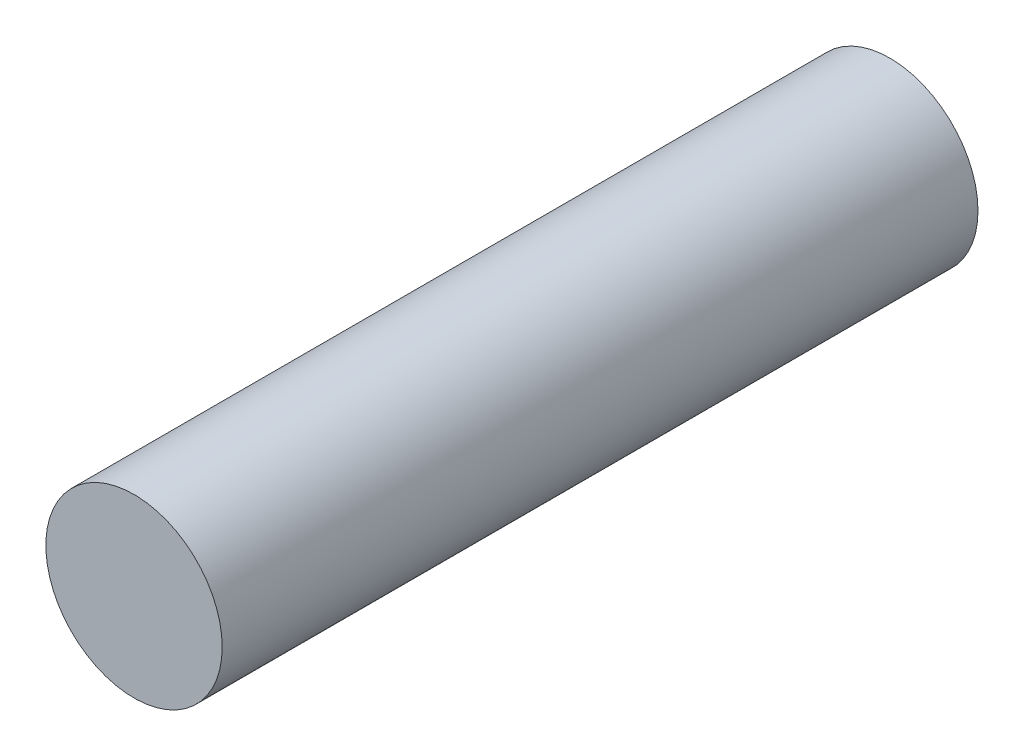
ISO-10303-21;
HEADER;
FILE_DESCRIPTION(('STEP AP214'),'2;1');
FILE_NAME('part.step','',(''),(''),'','','');
FILE_SCHEMA(('AUTOMOTIVE_DESIGN { 1 0 10303 214 1 1 1 1 }'));
ENDSEC;
DATA;
#1=APPLICATION_CONTEXT('core data for automotive mechanical design processes');
#2=APPLICATION_PROTOCOL_DEFINITION('international standard','automotive_design',2000,#1);
#3=PRODUCT_CONTEXT('',#1,'mechanical');
#4=PRODUCT('Part','Part','',(#3));
#5=PRODUCT_RELATED_PRODUCT_CATEGORY('part','',(#4));
#6=PRODUCT_DEFINITION_FORMATION('','',#4);
#7=PRODUCT_DEFINITION_CONTEXT('part definition',#1,'design');
#8=PRODUCT_DEFINITION('design','',#6,#7);
#9=PRODUCT_DEFINITION_SHAPE('','',#8);
#10=(LENGTH_UNIT() NAMED_UNIT(*) SI_UNIT(.MILLI.,.METRE.));
#11=(NAMED_UNIT(*) PLANE_ANGLE_UNIT() SI_UNIT($,.RADIAN.));
#12=(NAMED_UNIT(*) SI_UNIT($,.STERADIAN.) SOLID_ANGLE_UNIT());
#13=UNCERTAINTY_MEASURE_WITH_UNIT(LENGTH_MEASURE(1.E-05),#10,'distance_accuracy_value','');
#14=(GEOMETRIC_REPRESENTATION_CONTEXT(3) GLOBAL_UNCERTAINTY_ASSIGNED_CONTEXT((#13)) GLOBAL_UNIT_ASSIGNED_CONTEXT((#10,
#11,#12)) REPRESENTATION_CONTEXT('',''));
#15=CARTESIAN_POINT('',(0.,0.,0.));
#16=DIRECTION('',(0.,0.,1.));
#17=DIRECTION('',(1.,0.,0.));
#18=AXIS2_PLACEMENT_3D('',#15,#16,#17);
#19=CARTESIAN_POINT('',(0.,0.,3.));
#20=DIRECTION('',(0.,0.,-1.));
#21=DIRECTION('',(-1.,0.,0.));
#22=AXIS2_PLACEMENT_3D('',#19,#20,#21);
#23=CYLINDRICAL_SURFACE('',#22,0.35);
#24=CARTESIAN_POINT('',(0.,0.,3.));
#25=DIRECTION('',(0.,0.,1.));
#26=DIRECTION('',(1.,0.,0.));
#27=AXIS2_PLACEMENT_3D('',#24,#25,#26);
#28=CIRCLE('',#27,0.35);
#29=CARTESIAN_POINT('',(0.35,0.,3.));
#30=VERTEX_POINT('',#29);
#31=EDGE_CURVE('E10',#30,#30,#28,.T.);
#32=ORIENTED_EDGE('',*,*,#31,.F.);
#33=EDGE_LOOP('',(#32));
#34=FACE_BOUND('',#33,.T.);
#35=CARTESIAN_POINT('',(0.,0.,0.));
#36=DIRECTION('',(0.,0.,1.));
#37=DIRECTION('',(1.,0.,0.));
#38=AXIS2_PLACEMENT_3D('',#35,#36,#37);
#39=CIRCLE('',#38,0.35);
#40=CARTESIAN_POINT('',(0.35,0.,0.));
#41=VERTEX_POINT('',#40);
#42=EDGE_CURVE('E36',#41,#41,#39,.T.);
#43=ORIENTED_EDGE('',*,*,#42,.T.);
#44=EDGE_LOOP('',(#43));
#45=FACE_BOUND('',#44,.T.);
#46=ADVANCED_FACE('F33',(#34,#45),#23,.T.);
#47=CARTESIAN_POINT('',(0.,0.,3.));
#48=DIRECTION('',(0.,0.,1.));
#49=DIRECTION('',(1.,0.,0.));
#50=AXIS2_PLACEMENT_3D('',#47,#48,#49);
#51=PLANE('',#50);
#52=ORIENTED_EDGE('',*,*,#31,.T.);
#53=EDGE_LOOP('',(#52));
#54=FACE_BOUND('',#53,.T.);
#55=ADVANCED_FACE('F48',(#54),#51,.T.);
#56=CARTESIAN_POINT('',(0.,0.,0.));
#57=DIRECTION('',(0.,0.,1.));
#58=DIRECTION('',(1.,0.,0.));
#59=AXIS2_PLACEMENT_3D('',#56,#57,#58);
#60=PLANE('',#59);
#61=ORIENTED_EDGE('',*,*,#42,.F.);
#62=EDGE_LOOP('',(#61));
#63=FACE_BOUND('',#62,.T.);
#64=ADVANCED_FACE('F46',(#63),#60,.F.);
#65=CLOSED_SHELL('',(#46,#55,#64));
#66=MANIFOLD_SOLID_BREP('B2',#65);
#67=ADVANCED_BREP_SHAPE_REPRESENTATION('',(#18,#66),#14);
#68=SHAPE_DEFINITION_REPRESENTATION(#9,#67);
ENDSEC;
END-ISO-10303-21;
